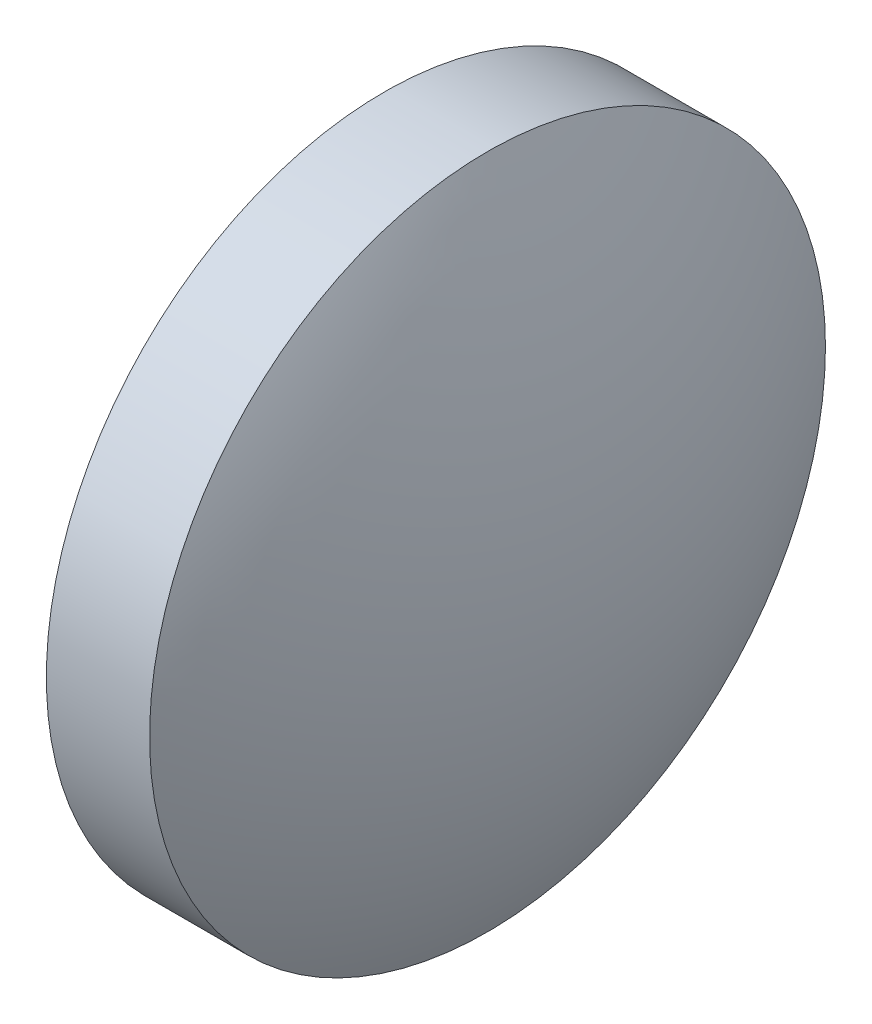
ISO-10303-21;
HEADER;
FILE_DESCRIPTION(('STEP AP214'),'2;1');
FILE_NAME('part.step','',(''),(''),'','','');
FILE_SCHEMA(('AUTOMOTIVE_DESIGN { 1 0 10303 214 1 1 1 1 }'));
ENDSEC;
DATA;
#1=APPLICATION_CONTEXT('core data for automotive mechanical design processes');
#2=APPLICATION_PROTOCOL_DEFINITION('international standard','automotive_design',2000,#1);
#3=PRODUCT_CONTEXT('',#1,'mechanical');
#4=PRODUCT('Part','Part','',(#3));
#5=PRODUCT_RELATED_PRODUCT_CATEGORY('part','',(#4));
#6=PRODUCT_DEFINITION_FORMATION('','',#4);
#7=PRODUCT_DEFINITION_CONTEXT('part definition',#1,'design');
#8=PRODUCT_DEFINITION('design','',#6,#7);
#9=PRODUCT_DEFINITION_SHAPE('','',#8);
#10=(LENGTH_UNIT() NAMED_UNIT(*) SI_UNIT(.MILLI.,.METRE.));
#11=(NAMED_UNIT(*) PLANE_ANGLE_UNIT() SI_UNIT($,.RADIAN.));
#12=(NAMED_UNIT(*) SI_UNIT($,.STERADIAN.) SOLID_ANGLE_UNIT());
#13=UNCERTAINTY_MEASURE_WITH_UNIT(LENGTH_MEASURE(1.E-05),#10,'distance_accuracy_value','');
#14=(GEOMETRIC_REPRESENTATION_CONTEXT(3) GLOBAL_UNCERTAINTY_ASSIGNED_CONTEXT((#13)) GLOBAL_UNIT_ASSIGNED_CONTEXT((#10,
#11,#12)) REPRESENTATION_CONTEXT('',''));
#15=CARTESIAN_POINT('',(0.,0.,0.));
#16=DIRECTION('',(0.,0.,1.));
#17=DIRECTION('',(1.,0.,0.));
#18=AXIS2_PLACEMENT_3D('',#15,#16,#17);
#19=CARTESIAN_POINT('',(2.5,0.,0.));
#20=DIRECTION('',(-1.,0.,0.));
#21=DIRECTION('',(0.,0.,1.));
#22=AXIS2_PLACEMENT_3D('',#19,#20,#21);
#23=CYLINDRICAL_SURFACE('',#22,8.185);
#24=CARTESIAN_POINT('',(2.5,0.,0.));
#25=DIRECTION('',(1.,0.,0.));
#26=DIRECTION('',(0.,0.,-1.));
#27=AXIS2_PLACEMENT_3D('',#24,#25,#26);
#28=CIRCLE('',#27,8.185);
#29=CARTESIAN_POINT('',(2.5,0.,-8.185));
#30=VERTEX_POINT('',#29);
#31=EDGE_CURVE('E10',#30,#30,#28,.T.);
#32=ORIENTED_EDGE('',*,*,#31,.F.);
#33=EDGE_LOOP('',(#32));
#34=FACE_BOUND('',#33,.T.);
#35=CARTESIAN_POINT('',(0.,0.,0.));
#36=DIRECTION('',(1.,0.,0.));
#37=DIRECTION('',(0.,0.,-1.));
#38=AXIS2_PLACEMENT_3D('',#35,#36,#37);
#39=CIRCLE('',#38,8.185);
#40=CARTESIAN_POINT('',(0.,0.,-8.185));
#41=VERTEX_POINT('',#40);
#42=EDGE_CURVE('E45',#41,#41,#39,.T.);
#43=ORIENTED_EDGE('',*,*,#42,.T.);
#44=EDGE_LOOP('',(#43));
#45=FACE_BOUND('',#44,.T.);
#46=ADVANCED_FACE('F37',(#34,#45),#23,.T.);
#47=CARTESIAN_POINT('',(-13.24855625,0.,0.));
#48=DIRECTION('',(0.,0.,1.));
#49=DIRECTION('',(1.,0.,0.));
#50=AXIS2_PLACEMENT_3D('',#47,#48,#49);
#51=SPHERICAL_SURFACE('',#50,17.74855625);
#52=CARTESIAN_POINT('',(-13.24855625,0.,0.));
#53=DIRECTION('',(1.,0.,0.));
#54=DIRECTION('',(0.,0.,-1.));
#55=AXIS2_PLACEMENT_3D('',#52,#53,#54);
#56=SPHERICAL_SURFACE('',#55,17.74855625);
#57=ORIENTED_EDGE('',*,*,#31,.T.);
#58=EDGE_LOOP('',(#57));
#59=FACE_BOUND('',#58,.T.);
#60=ADVANCED_FACE('F39',(#59),#56,.T.);
#61=CARTESIAN_POINT('',(0.,0.,0.));
#62=DIRECTION('',(1.,0.,0.));
#63=DIRECTION('',(0.,0.,-1.));
#64=AXIS2_PLACEMENT_3D('',#61,#62,#63);
#65=PLANE('',#64);
#66=ORIENTED_EDGE('',*,*,#42,.F.);
#67=EDGE_LOOP('',(#66));
#68=FACE_BOUND('',#67,.T.);
#69=ADVANCED_FACE('F53',(#68),#65,.F.);
#70=CLOSED_SHELL('',(#46,#60,#69));
#71=MANIFOLD_SOLID_BREP('B2',#70);
#72=ADVANCED_BREP_SHAPE_REPRESENTATION('',(#18,#71),#14);
#73=SHAPE_DEFINITION_REPRESENTATION(#9,#72);
ENDSEC;
END-ISO-10303-21;
